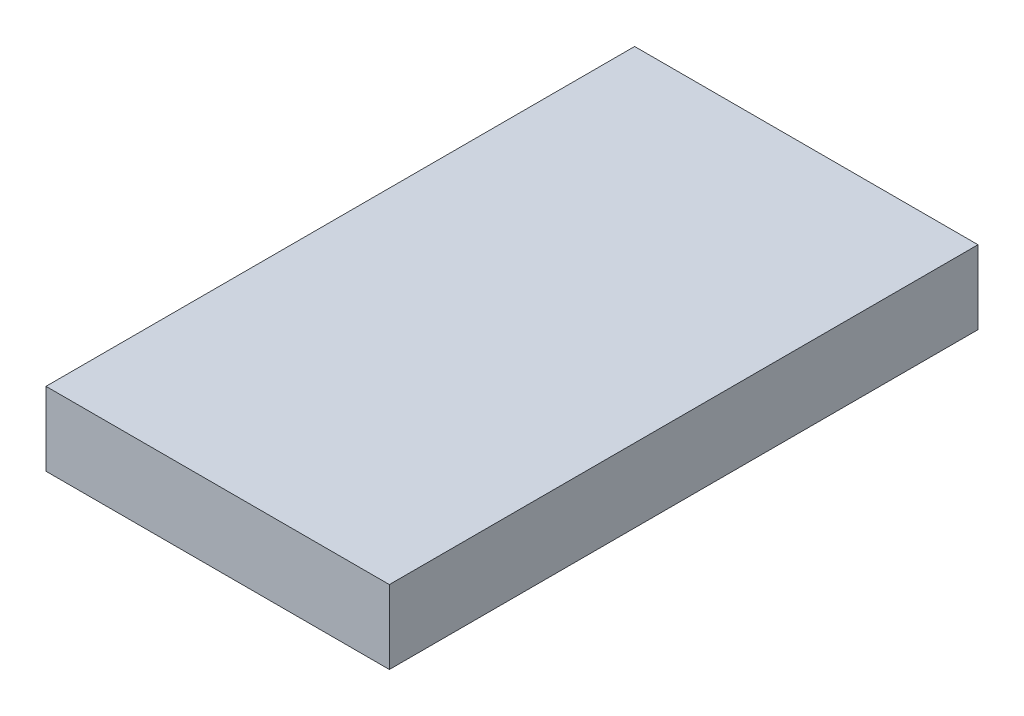
ISO-10303-21;
HEADER;
FILE_DESCRIPTION(('STEP AP214'),'2;1');
FILE_NAME('part.step','',(''),(''),'','','');
FILE_SCHEMA(('AUTOMOTIVE_DESIGN { 1 0 10303 214 1 1 1 1 }'));
ENDSEC;
DATA;
#1=APPLICATION_CONTEXT('core data for automotive mechanical design processes');
#2=APPLICATION_PROTOCOL_DEFINITION('international standard','automotive_design',2000,#1);
#3=PRODUCT_CONTEXT('',#1,'mechanical');
#4=PRODUCT('Part','Part','',(#3));
#5=PRODUCT_RELATED_PRODUCT_CATEGORY('part','',(#4));
#6=PRODUCT_DEFINITION_FORMATION('','',#4);
#7=PRODUCT_DEFINITION_CONTEXT('part definition',#1,'design');
#8=PRODUCT_DEFINITION('design','',#6,#7);
#9=PRODUCT_DEFINITION_SHAPE('','',#8);
#10=(LENGTH_UNIT() NAMED_UNIT(*) SI_UNIT(.MILLI.,.METRE.));
#11=(NAMED_UNIT(*) PLANE_ANGLE_UNIT() SI_UNIT($,.RADIAN.));
#12=(NAMED_UNIT(*) SI_UNIT($,.STERADIAN.) SOLID_ANGLE_UNIT());
#13=UNCERTAINTY_MEASURE_WITH_UNIT(LENGTH_MEASURE(1.E-05),#10,'distance_accuracy_value','');
#14=(GEOMETRIC_REPRESENTATION_CONTEXT(3) GLOBAL_UNCERTAINTY_ASSIGNED_CONTEXT((#13)) GLOBAL_UNIT_ASSIGNED_CONTEXT((#10,
#11,#12)) REPRESENTATION_CONTEXT('',''));
#15=CARTESIAN_POINT('',(0.,0.,0.));
#16=DIRECTION('',(0.,0.,1.));
#17=DIRECTION('',(1.,0.,0.));
#18=AXIS2_PLACEMENT_3D('',#15,#16,#17);
#19=CARTESIAN_POINT('',(0.,7.62,0.));
#20=DIRECTION('',(1.,0.,0.));
#21=DIRECTION('',(0.,0.,-1.));
#22=AXIS2_PLACEMENT_3D('',#19,#20,#21);
#23=PLANE('',#22);
#24=DIRECTION('',(0.,0.,1.));
#25=VECTOR('',#24,1.);
#26=CARTESIAN_POINT('',(0.,0.,0.));
#27=LINE('',#26,#25);
#28=CARTESIAN_POINT('',(0.,0.,-60.96));
#29=VERTEX_POINT('',#28);
#30=CARTESIAN_POINT('',(0.,0.,0.));
#31=VERTEX_POINT('',#30);
#32=EDGE_CURVE('E107',#29,#31,#27,.T.);
#33=ORIENTED_EDGE('',*,*,#32,.T.);
#34=DIRECTION('',(0.,-1.,0.));
#35=VECTOR('',#34,1.);
#36=CARTESIAN_POINT('',(0.,7.62,0.));
#37=LINE('',#36,#35);
#38=CARTESIAN_POINT('',(0.,7.62,0.));
#39=VERTEX_POINT('',#38);
#40=EDGE_CURVE('E11',#39,#31,#37,.T.);
#41=ORIENTED_EDGE('',*,*,#40,.F.);
#42=DIRECTION('',(0.,0.,1.));
#43=VECTOR('',#42,1.);
#44=CARTESIAN_POINT('',(0.,7.62,0.));
#45=LINE('',#44,#43);
#46=CARTESIAN_POINT('',(0.,7.62,-60.96));
#47=VERTEX_POINT('',#46);
#48=EDGE_CURVE('E91',#47,#39,#45,.T.);
#49=ORIENTED_EDGE('',*,*,#48,.F.);
#50=DIRECTION('',(0.,-1.,0.));
#51=VECTOR('',#50,1.);
#52=CARTESIAN_POINT('',(0.,7.62,-60.96));
#53=LINE('',#52,#51);
#54=EDGE_CURVE('E103',#47,#29,#53,.T.);
#55=ORIENTED_EDGE('',*,*,#54,.T.);
#56=EDGE_LOOP('',(#33,#41,#49,#55));
#57=FACE_BOUND('',#56,.T.);
#58=ADVANCED_FACE('F39',(#57),#23,.F.);
#59=CARTESIAN_POINT('',(0.,7.62,0.));
#60=DIRECTION('',(0.,0.,-1.));
#61=DIRECTION('',(-1.,0.,0.));
#62=AXIS2_PLACEMENT_3D('',#59,#60,#61);
#63=PLANE('',#62);
#64=DIRECTION('',(1.,0.,0.));
#65=VECTOR('',#64,1.);
#66=CARTESIAN_POINT('',(0.,0.,0.));
#67=LINE('',#66,#65);
#68=CARTESIAN_POINT('',(35.56,0.,0.));
#69=VERTEX_POINT('',#68);
#70=EDGE_CURVE('E96',#31,#69,#67,.T.);
#71=ORIENTED_EDGE('',*,*,#70,.T.);
#72=DIRECTION('',(0.,-1.,0.));
#73=VECTOR('',#72,1.);
#74=CARTESIAN_POINT('',(35.56,7.62,0.));
#75=LINE('',#74,#73);
#76=CARTESIAN_POINT('',(35.56,7.62,0.));
#77=VERTEX_POINT('',#76);
#78=EDGE_CURVE('E48',#77,#69,#75,.T.);
#79=ORIENTED_EDGE('',*,*,#78,.F.);
#80=DIRECTION('',(1.,0.,0.));
#81=VECTOR('',#80,1.);
#82=CARTESIAN_POINT('',(0.,7.62,0.));
#83=LINE('',#82,#81);
#84=EDGE_CURVE('E86',#39,#77,#83,.T.);
#85=ORIENTED_EDGE('',*,*,#84,.F.);
#86=ORIENTED_EDGE('',*,*,#40,.T.);
#87=EDGE_LOOP('',(#71,#79,#85,#86));
#88=FACE_BOUND('',#87,.T.);
#89=ADVANCED_FACE('F95',(#88),#63,.F.);
#90=CARTESIAN_POINT('',(35.56,7.62,0.));
#91=DIRECTION('',(-1.,0.,0.));
#92=DIRECTION('',(0.,0.,1.));
#93=AXIS2_PLACEMENT_3D('',#90,#91,#92);
#94=PLANE('',#93);
#95=DIRECTION('',(0.,0.,-1.));
#96=VECTOR('',#95,1.);
#97=CARTESIAN_POINT('',(35.56,0.,0.));
#98=LINE('',#97,#96);
#99=CARTESIAN_POINT('',(35.56,0.,-60.96));
#100=VERTEX_POINT('',#99);
#101=EDGE_CURVE('E73',#69,#100,#98,.T.);
#102=ORIENTED_EDGE('',*,*,#101,.T.);
#103=DIRECTION('',(0.,-1.,0.));
#104=VECTOR('',#103,1.);
#105=CARTESIAN_POINT('',(35.56,7.62,-60.96));
#106=LINE('',#105,#104);
#107=CARTESIAN_POINT('',(35.56,7.62,-60.96));
#108=VERTEX_POINT('',#107);
#109=EDGE_CURVE('E98',#108,#100,#106,.T.);
#110=ORIENTED_EDGE('',*,*,#109,.F.);
#111=DIRECTION('',(0.,0.,-1.));
#112=VECTOR('',#111,1.);
#113=CARTESIAN_POINT('',(35.56,7.62,0.));
#114=LINE('',#113,#112);
#115=EDGE_CURVE('E89',#77,#108,#114,.T.);
#116=ORIENTED_EDGE('',*,*,#115,.F.);
#117=ORIENTED_EDGE('',*,*,#78,.T.);
#118=EDGE_LOOP('',(#102,#110,#116,#117));
#119=FACE_BOUND('',#118,.T.);
#120=ADVANCED_FACE('F99',(#119),#94,.F.);
#121=CARTESIAN_POINT('',(0.,7.62,-60.96));
#122=DIRECTION('',(0.,0.,1.));
#123=DIRECTION('',(1.,0.,0.));
#124=AXIS2_PLACEMENT_3D('',#121,#122,#123);
#125=PLANE('',#124);
#126=DIRECTION('',(-1.,0.,0.));
#127=VECTOR('',#126,1.);
#128=CARTESIAN_POINT('',(0.,0.,-60.96));
#129=LINE('',#128,#127);
#130=EDGE_CURVE('E79',#100,#29,#129,.T.);
#131=ORIENTED_EDGE('',*,*,#130,.T.);
#132=ORIENTED_EDGE('',*,*,#54,.F.);
#133=DIRECTION('',(-1.,0.,0.));
#134=VECTOR('',#133,1.);
#135=CARTESIAN_POINT('',(0.,7.62,-60.96));
#136=LINE('',#135,#134);
#137=EDGE_CURVE('E56',#108,#47,#136,.T.);
#138=ORIENTED_EDGE('',*,*,#137,.F.);
#139=ORIENTED_EDGE('',*,*,#109,.T.);
#140=EDGE_LOOP('',(#131,#132,#138,#139));
#141=FACE_BOUND('',#140,.T.);
#142=ADVANCED_FACE('F120',(#141),#125,.F.);
#143=CARTESIAN_POINT('',(0.,7.62,0.));
#144=DIRECTION('',(0.,-1.,0.));
#145=DIRECTION('',(0.,0.,-1.));
#146=AXIS2_PLACEMENT_3D('',#143,#144,#145);
#147=PLANE('',#146);
#148=ORIENTED_EDGE('',*,*,#48,.T.);
#149=ORIENTED_EDGE('',*,*,#84,.T.);
#150=ORIENTED_EDGE('',*,*,#115,.T.);
#151=ORIENTED_EDGE('',*,*,#137,.T.);
#152=EDGE_LOOP('',(#148,#149,#150,#151));
#153=FACE_BOUND('',#152,.T.);
#154=ADVANCED_FACE('F87',(#153),#147,.F.);
#155=CARTESIAN_POINT('',(0.,0.,0.));
#156=DIRECTION('',(0.,-1.,0.));
#157=DIRECTION('',(0.,0.,-1.));
#158=AXIS2_PLACEMENT_3D('',#155,#156,#157);
#159=PLANE('',#158);
#160=ORIENTED_EDGE('',*,*,#32,.F.);
#161=ORIENTED_EDGE('',*,*,#130,.F.);
#162=ORIENTED_EDGE('',*,*,#101,.F.);
#163=ORIENTED_EDGE('',*,*,#70,.F.);
#164=EDGE_LOOP('',(#160,#161,#162,#163));
#165=FACE_BOUND('',#164,.T.);
#166=ADVANCED_FACE('F123',(#165),#159,.T.);
#167=CLOSED_SHELL('',(#58,#89,#120,#142,#154,#166));
#168=MANIFOLD_SOLID_BREP('B2',#167);
#169=ADVANCED_BREP_SHAPE_REPRESENTATION('',(#18,#168),#14);
#170=SHAPE_DEFINITION_REPRESENTATION(#9,#169);
ENDSEC;
END-ISO-10303-21;
